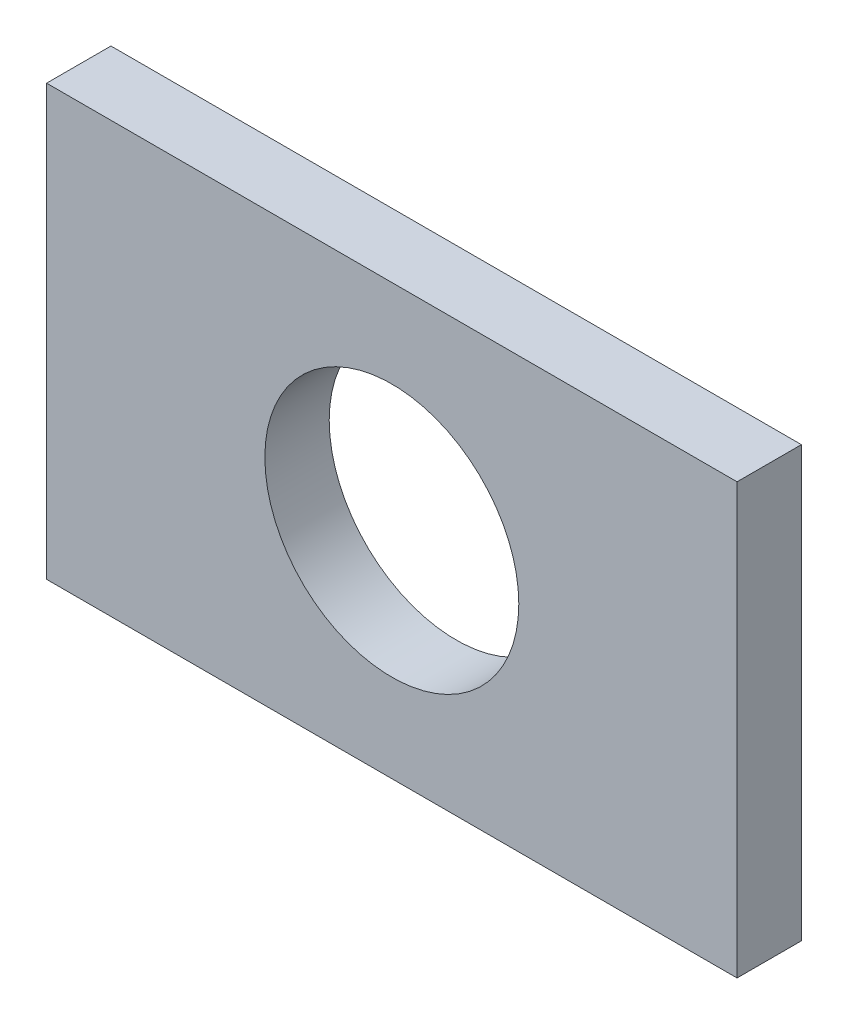
ISO-10303-21;
HEADER;
FILE_DESCRIPTION(('STEP AP214'),'2;1');
FILE_NAME('part.step','',(''),(''),'','','');
FILE_SCHEMA(('AUTOMOTIVE_DESIGN { 1 0 10303 214 1 1 1 1 }'));
ENDSEC;
DATA;
#1=APPLICATION_CONTEXT('core data for automotive mechanical design processes');
#2=APPLICATION_PROTOCOL_DEFINITION('international standard','automotive_design',2000,#1);
#3=PRODUCT_CONTEXT('',#1,'mechanical');
#4=PRODUCT('Part','Part','',(#3));
#5=PRODUCT_RELATED_PRODUCT_CATEGORY('part','',(#4));
#6=PRODUCT_DEFINITION_FORMATION('','',#4);
#7=PRODUCT_DEFINITION_CONTEXT('part definition',#1,'design');
#8=PRODUCT_DEFINITION('design','',#6,#7);
#9=PRODUCT_DEFINITION_SHAPE('','',#8);
#10=(LENGTH_UNIT() NAMED_UNIT(*) SI_UNIT(.MILLI.,.METRE.));
#11=(NAMED_UNIT(*) PLANE_ANGLE_UNIT() SI_UNIT($,.RADIAN.));
#12=(NAMED_UNIT(*) SI_UNIT($,.STERADIAN.) SOLID_ANGLE_UNIT());
#13=UNCERTAINTY_MEASURE_WITH_UNIT(LENGTH_MEASURE(1.E-05),#10,'distance_accuracy_value','');
#14=(GEOMETRIC_REPRESENTATION_CONTEXT(3) GLOBAL_UNCERTAINTY_ASSIGNED_CONTEXT((#13)) GLOBAL_UNIT_ASSIGNED_CONTEXT((#10,
#11,#12)) REPRESENTATION_CONTEXT('',''));
#15=CARTESIAN_POINT('',(0.,0.,0.));
#16=DIRECTION('',(0.,0.,1.));
#17=DIRECTION('',(1.,0.,0.));
#18=AXIS2_PLACEMENT_3D('',#15,#16,#17);
#19=CARTESIAN_POINT('',(53.6470152839005,33.3891860465116,10.));
#20=DIRECTION('',(-1.,0.,0.));
#21=DIRECTION('',(0.,0.,1.));
#22=AXIS2_PLACEMENT_3D('',#19,#20,#21);
#23=PLANE('',#22);
#24=DIRECTION('',(0.,1.,0.));
#25=VECTOR('',#24,1.);
#26=CARTESIAN_POINT('',(53.6470152839005,33.3891860465116,0.));
#27=LINE('',#26,#25);
#28=CARTESIAN_POINT('',(53.6470152839005,-33.3891860465116,0.));
#29=VERTEX_POINT('',#28);
#30=CARTESIAN_POINT('',(53.6470152839005,33.3891860465116,0.));
#31=VERTEX_POINT('',#30);
#32=EDGE_CURVE('E96',#29,#31,#27,.T.);
#33=ORIENTED_EDGE('',*,*,#32,.T.);
#34=DIRECTION('',(0.,0.,-1.));
#35=VECTOR('',#34,1.);
#36=CARTESIAN_POINT('',(53.6470152839005,33.3891860465116,10.));
#37=LINE('',#36,#35);
#38=CARTESIAN_POINT('',(53.6470152839005,33.3891860465116,10.));
#39=VERTEX_POINT('',#38);
#40=EDGE_CURVE('E11',#39,#31,#37,.T.);
#41=ORIENTED_EDGE('',*,*,#40,.F.);
#42=DIRECTION('',(0.,1.,0.));
#43=VECTOR('',#42,1.);
#44=CARTESIAN_POINT('',(53.6470152839005,33.3891860465116,10.));
#45=LINE('',#44,#43);
#46=CARTESIAN_POINT('',(53.6470152839005,-33.3891860465116,10.));
#47=VERTEX_POINT('',#46);
#48=EDGE_CURVE('E84',#47,#39,#45,.T.);
#49=ORIENTED_EDGE('',*,*,#48,.F.);
#50=DIRECTION('',(0.,0.,-1.));
#51=VECTOR('',#50,1.);
#52=CARTESIAN_POINT('',(53.6470152839005,-33.3891860465116,10.));
#53=LINE('',#52,#51);
#54=EDGE_CURVE('E92',#47,#29,#53,.T.);
#55=ORIENTED_EDGE('',*,*,#54,.T.);
#56=EDGE_LOOP('',(#33,#41,#49,#55));
#57=FACE_BOUND('',#56,.T.);
#58=ADVANCED_FACE('F33',(#57),#23,.F.);
#59=CARTESIAN_POINT('',(-53.6470152839005,33.3891860465116,10.));
#60=DIRECTION('',(0.,-1.,0.));
#61=DIRECTION('',(0.,0.,-1.));
#62=AXIS2_PLACEMENT_3D('',#59,#60,#61);
#63=PLANE('',#62);
#64=DIRECTION('',(-1.,0.,0.));
#65=VECTOR('',#64,1.);
#66=CARTESIAN_POINT('',(-53.6470152839005,33.3891860465116,0.));
#67=LINE('',#66,#65);
#68=CARTESIAN_POINT('',(-53.6470152839005,33.3891860465116,0.));
#69=VERTEX_POINT('',#68);
#70=EDGE_CURVE('E88',#31,#69,#67,.T.);
#71=ORIENTED_EDGE('',*,*,#70,.T.);
#72=DIRECTION('',(0.,0.,-1.));
#73=VECTOR('',#72,1.);
#74=CARTESIAN_POINT('',(-53.6470152839005,33.3891860465116,10.));
#75=LINE('',#74,#73);
#76=CARTESIAN_POINT('',(-53.6470152839005,33.3891860465116,10.));
#77=VERTEX_POINT('',#76);
#78=EDGE_CURVE('E41',#77,#69,#75,.T.);
#79=ORIENTED_EDGE('',*,*,#78,.F.);
#80=DIRECTION('',(-1.,0.,0.));
#81=VECTOR('',#80,1.);
#82=CARTESIAN_POINT('',(-53.6470152839005,33.3891860465116,10.));
#83=LINE('',#82,#81);
#84=EDGE_CURVE('E79',#39,#77,#83,.T.);
#85=ORIENTED_EDGE('',*,*,#84,.F.);
#86=ORIENTED_EDGE('',*,*,#40,.T.);
#87=EDGE_LOOP('',(#71,#79,#85,#86));
#88=FACE_BOUND('',#87,.T.);
#89=ADVANCED_FACE('F87',(#88),#63,.F.);
#90=CARTESIAN_POINT('',(-53.6470152839005,33.3891860465116,10.));
#91=DIRECTION('',(1.,0.,0.));
#92=DIRECTION('',(0.,0.,-1.));
#93=AXIS2_PLACEMENT_3D('',#90,#91,#92);
#94=PLANE('',#93);
#95=DIRECTION('',(0.,-1.,0.));
#96=VECTOR('',#95,1.);
#97=CARTESIAN_POINT('',(-53.6470152839005,33.3891860465116,0.));
#98=LINE('',#97,#96);
#99=CARTESIAN_POINT('',(-53.6470152839005,-33.3891860465116,0.));
#100=VERTEX_POINT('',#99);
#101=EDGE_CURVE('E66',#69,#100,#98,.T.);
#102=ORIENTED_EDGE('',*,*,#101,.T.);
#103=DIRECTION('',(0.,0.,-1.));
#104=VECTOR('',#103,1.);
#105=CARTESIAN_POINT('',(-53.6470152839005,-33.3891860465116,10.));
#106=LINE('',#105,#104);
#107=CARTESIAN_POINT('',(-53.6470152839005,-33.3891860465116,10.));
#108=VERTEX_POINT('',#107);
#109=EDGE_CURVE('E89',#108,#100,#106,.T.);
#110=ORIENTED_EDGE('',*,*,#109,.F.);
#111=DIRECTION('',(0.,-1.,0.));
#112=VECTOR('',#111,1.);
#113=CARTESIAN_POINT('',(-53.6470152839005,33.3891860465116,10.));
#114=LINE('',#113,#112);
#115=EDGE_CURVE('E82',#77,#108,#114,.T.);
#116=ORIENTED_EDGE('',*,*,#115,.F.);
#117=ORIENTED_EDGE('',*,*,#78,.T.);
#118=EDGE_LOOP('',(#102,#110,#116,#117));
#119=FACE_BOUND('',#118,.T.);
#120=ADVANCED_FACE('F90',(#119),#94,.F.);
#121=CARTESIAN_POINT('',(-53.6470152839005,-33.3891860465116,10.));
#122=DIRECTION('',(0.,1.,0.));
#123=DIRECTION('',(0.,0.,1.));
#124=AXIS2_PLACEMENT_3D('',#121,#122,#123);
#125=PLANE('',#124);
#126=DIRECTION('',(1.,0.,0.));
#127=VECTOR('',#126,1.);
#128=CARTESIAN_POINT('',(-53.6470152839005,-33.3891860465116,0.));
#129=LINE('',#128,#127);
#130=EDGE_CURVE('E72',#100,#29,#129,.T.);
#131=ORIENTED_EDGE('',*,*,#130,.T.);
#132=ORIENTED_EDGE('',*,*,#54,.F.);
#133=DIRECTION('',(1.,0.,0.));
#134=VECTOR('',#133,1.);
#135=CARTESIAN_POINT('',(-53.6470152839005,-33.3891860465116,10.));
#136=LINE('',#135,#134);
#137=EDGE_CURVE('E49',#108,#47,#136,.T.);
#138=ORIENTED_EDGE('',*,*,#137,.F.);
#139=ORIENTED_EDGE('',*,*,#109,.T.);
#140=EDGE_LOOP('',(#131,#132,#138,#139));
#141=FACE_BOUND('',#140,.T.);
#142=ADVANCED_FACE('F104',(#141),#125,.F.);
#143=CARTESIAN_POINT('',(0.,0.,10.));
#144=DIRECTION('',(0.,0.,1.));
#145=DIRECTION('',(1.,0.,0.));
#146=AXIS2_PLACEMENT_3D('',#143,#144,#145);
#147=PLANE('',#146);
#148=CARTESIAN_POINT('',(0.,0.,10.));
#149=DIRECTION('',(0.,0.,1.));
#150=DIRECTION('',(1.,0.,0.));
#151=AXIS2_PLACEMENT_3D('',#148,#149,#150);
#152=CIRCLE('',#151,19.7317978565898);
#153=CARTESIAN_POINT('',(19.7317978565898,0.,10.));
#154=VERTEX_POINT('',#153);
#155=EDGE_CURVE('E110',#154,#154,#152,.T.);
#156=ORIENTED_EDGE('',*,*,#155,.F.);
#157=EDGE_LOOP('',(#156));
#158=FACE_BOUND('',#157,.T.);
#159=ORIENTED_EDGE('',*,*,#48,.T.);
#160=ORIENTED_EDGE('',*,*,#84,.T.);
#161=ORIENTED_EDGE('',*,*,#115,.T.);
#162=ORIENTED_EDGE('',*,*,#137,.T.);
#163=EDGE_LOOP('',(#159,#160,#161,#162));
#164=FACE_BOUND('',#163,.T.);
#165=ADVANCED_FACE('F80',(#158,#164),#147,.T.);
#166=CARTESIAN_POINT('',(0.,0.,0.));
#167=DIRECTION('',(0.,0.,1.));
#168=DIRECTION('',(1.,0.,0.));
#169=AXIS2_PLACEMENT_3D('',#166,#167,#168);
#170=PLANE('',#169);
#171=CARTESIAN_POINT('',(0.,0.,0.));
#172=DIRECTION('',(0.,0.,1.));
#173=DIRECTION('',(1.,0.,0.));
#174=AXIS2_PLACEMENT_3D('',#171,#172,#173);
#175=CIRCLE('',#174,19.7317978565898);
#176=CARTESIAN_POINT('',(19.7317978565898,0.,0.));
#177=VERTEX_POINT('',#176);
#178=EDGE_CURVE('E99',#177,#177,#175,.T.);
#179=ORIENTED_EDGE('',*,*,#178,.T.);
#180=EDGE_LOOP('',(#179));
#181=FACE_BOUND('',#180,.T.);
#182=ORIENTED_EDGE('',*,*,#32,.F.);
#183=ORIENTED_EDGE('',*,*,#130,.F.);
#184=ORIENTED_EDGE('',*,*,#101,.F.);
#185=ORIENTED_EDGE('',*,*,#70,.F.);
#186=EDGE_LOOP('',(#182,#183,#184,#185));
#187=FACE_BOUND('',#186,.T.);
#188=ADVANCED_FACE('F107',(#181,#187),#170,.F.);
#189=CARTESIAN_POINT('',(0.,0.,0.));
#190=DIRECTION('',(0.,0.,1.));
#191=DIRECTION('',(1.,0.,0.));
#192=AXIS2_PLACEMENT_3D('',#189,#190,#191);
#193=CYLINDRICAL_SURFACE('',#192,19.7317978565898);
#194=ORIENTED_EDGE('',*,*,#178,.F.);
#195=EDGE_LOOP('',(#194));
#196=FACE_BOUND('',#195,.T.);
#197=ORIENTED_EDGE('',*,*,#155,.T.);
#198=EDGE_LOOP('',(#197));
#199=FACE_BOUND('',#198,.T.);
#200=ADVANCED_FACE('F117',(#196,#199),#193,.F.);
#201=CLOSED_SHELL('',(#58,#89,#120,#142,#165,#188,#200));
#202=MANIFOLD_SOLID_BREP('B2',#201);
#203=ADVANCED_BREP_SHAPE_REPRESENTATION('',(#18,#202),#14);
#204=SHAPE_DEFINITION_REPRESENTATION(#9,#203);
ENDSEC;
END-ISO-10303-21;
